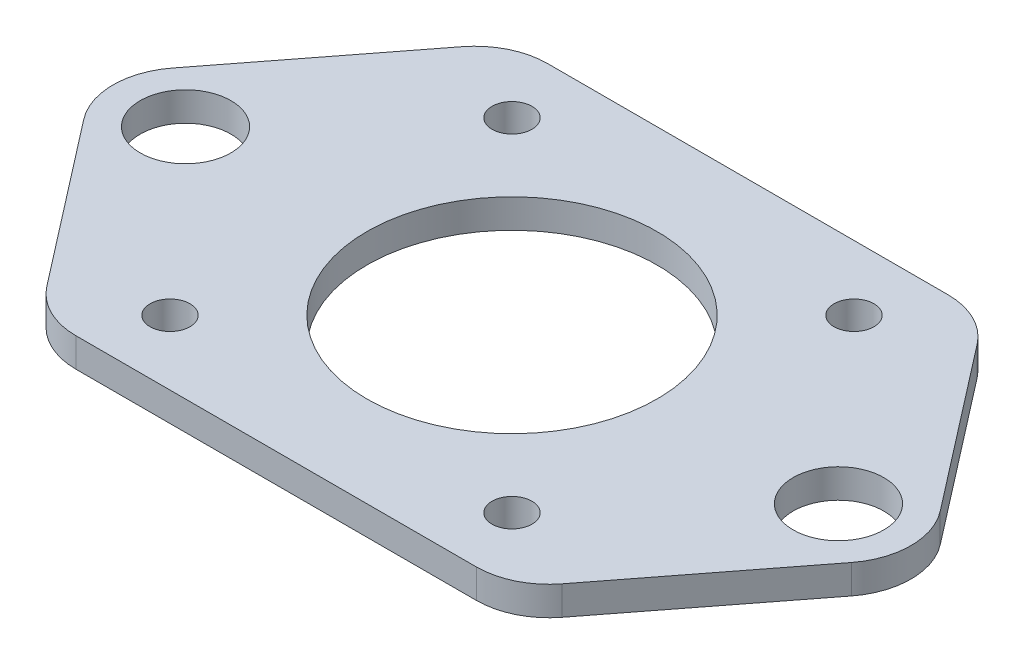
ISO-10303-21;
HEADER;
FILE_DESCRIPTION(('STEP AP214'),'2;1');
FILE_NAME('part.step','',(''),(''),'','','');
FILE_SCHEMA(('AUTOMOTIVE_DESIGN { 1 0 10303 214 1 1 1 1 }'));
ENDSEC;
DATA;
#1=APPLICATION_CONTEXT('core data for automotive mechanical design processes');
#2=APPLICATION_PROTOCOL_DEFINITION('international standard','automotive_design',2000,#1);
#3=PRODUCT_CONTEXT('',#1,'mechanical');
#4=PRODUCT('Part','Part','',(#3));
#5=PRODUCT_RELATED_PRODUCT_CATEGORY('part','',(#4));
#6=PRODUCT_DEFINITION_FORMATION('','',#4);
#7=PRODUCT_DEFINITION_CONTEXT('part definition',#1,'design');
#8=PRODUCT_DEFINITION('design','',#6,#7);
#9=PRODUCT_DEFINITION_SHAPE('','',#8);
#10=(LENGTH_UNIT() NAMED_UNIT(*) SI_UNIT(.MILLI.,.METRE.));
#11=(NAMED_UNIT(*) PLANE_ANGLE_UNIT() SI_UNIT($,.RADIAN.));
#12=(NAMED_UNIT(*) SI_UNIT($,.STERADIAN.) SOLID_ANGLE_UNIT());
#13=UNCERTAINTY_MEASURE_WITH_UNIT(LENGTH_MEASURE(1.E-05),#10,'distance_accuracy_value','');
#14=(GEOMETRIC_REPRESENTATION_CONTEXT(3) GLOBAL_UNCERTAINTY_ASSIGNED_CONTEXT((#13)) GLOBAL_UNIT_ASSIGNED_CONTEXT((#10,
#11,#12)) REPRESENTATION_CONTEXT('',''));
#15=CARTESIAN_POINT('',(0.,0.,0.));
#16=DIRECTION('',(0.,0.,1.));
#17=DIRECTION('',(1.,0.,0.));
#18=AXIS2_PLACEMENT_3D('',#15,#16,#17);
#19=CARTESIAN_POINT('',(-32.4999999999999,-4.,-32.5));
#20=DIRECTION('',(0.,0.,-1.));
#21=DIRECTION('',(-1.,0.,0.));
#22=AXIS2_PLACEMENT_3D('',#19,#20,#21);
#23=PLANE('',#22);
#24=DIRECTION('',(-1.,0.,0.));
#25=VECTOR('',#24,1.);
#26=CARTESIAN_POINT('',(-32.4999999999999,-4.,-32.5));
#27=LINE('',#26,#25);
#28=CARTESIAN_POINT('',(27.5931387858081,-4.,-32.5));
#29=VERTEX_POINT('',#28);
#30=CARTESIAN_POINT('',(-27.593138785808,-4.,-32.5));
#31=VERTEX_POINT('',#30);
#32=EDGE_CURVE('E142',#29,#31,#27,.T.);
#33=ORIENTED_EDGE('',*,*,#32,.T.);
#34=DIRECTION('',(0.,1.,0.));
#35=VECTOR('',#34,1.);
#36=CARTESIAN_POINT('',(-27.593138785808,-4.,-32.5));
#37=LINE('',#36,#35);
#38=CARTESIAN_POINT('',(-27.593138785808,0.,-32.5));
#39=VERTEX_POINT('',#38);
#40=EDGE_CURVE('E196',#31,#39,#37,.T.);
#41=ORIENTED_EDGE('',*,*,#40,.T.);
#42=DIRECTION('',(-1.,0.,0.));
#43=VECTOR('',#42,1.);
#44=CARTESIAN_POINT('',(-32.4999999999999,0.,-32.5));
#45=LINE('',#44,#43);
#46=CARTESIAN_POINT('',(27.5931387858081,0.,-32.5));
#47=VERTEX_POINT('',#46);
#48=EDGE_CURVE('E167',#47,#39,#45,.T.);
#49=ORIENTED_EDGE('',*,*,#48,.F.);
#50=DIRECTION('',(0.,1.,0.));
#51=VECTOR('',#50,1.);
#52=CARTESIAN_POINT('',(27.5931387858081,-4.,-32.5));
#53=LINE('',#52,#51);
#54=EDGE_CURVE('E190',#47,#29,#53,.F.);
#55=ORIENTED_EDGE('',*,*,#54,.T.);
#56=EDGE_LOOP('',(#33,#41,#49,#55));
#57=FACE_BOUND('',#56,.T.);
#58=ADVANCED_FACE('F40',(#57),#23,.T.);
#59=CARTESIAN_POINT('',(32.5000000000001,-4.,-32.5));
#60=DIRECTION('',(0.790936251719807,0.,-0.61189855835377));
#61=DIRECTION('',(-0.61189855835377,0.,-0.790936251719807));
#62=AXIS2_PLACEMENT_3D('',#59,#60,#61);
#63=PLANE('',#62);
#64=DIRECTION('',(-0.61189855835377,0.,-0.790936251719807));
#65=VECTOR('',#64,1.);
#66=CARTESIAN_POINT('',(32.5000000000001,-4.,-32.5));
#67=LINE('',#66,#65);
#68=CARTESIAN_POINT('',(52.9093625171981,-4.,-6.1189855835377));
#69=VERTEX_POINT('',#68);
#70=CARTESIAN_POINT('',(35.5025013030062,-4.,-28.6189855835377));
#71=VERTEX_POINT('',#70);
#72=EDGE_CURVE('E150',#69,#71,#67,.T.);
#73=ORIENTED_EDGE('',*,*,#72,.T.);
#74=DIRECTION('',(0.,1.,0.));
#75=VECTOR('',#74,1.);
#76=CARTESIAN_POINT('',(35.5025013030062,-4.,-28.6189855835377));
#77=LINE('',#76,#75);
#78=CARTESIAN_POINT('',(35.5025013030062,0.,-28.6189855835377));
#79=VERTEX_POINT('',#78);
#80=EDGE_CURVE('E214',#71,#79,#77,.T.);
#81=ORIENTED_EDGE('',*,*,#80,.T.);
#82=DIRECTION('',(-0.61189855835377,0.,-0.790936251719807));
#83=VECTOR('',#82,1.);
#84=CARTESIAN_POINT('',(32.5000000000001,0.,-32.5));
#85=LINE('',#84,#83);
#86=CARTESIAN_POINT('',(52.9093625171981,0.,-6.1189855835377));
#87=VERTEX_POINT('',#86);
#88=EDGE_CURVE('E185',#87,#79,#85,.T.);
#89=ORIENTED_EDGE('',*,*,#88,.F.);
#90=DIRECTION('',(0.,1.,0.));
#91=VECTOR('',#90,1.);
#92=CARTESIAN_POINT('',(52.9093625171981,-4.,-6.1189855835377));
#93=LINE('',#92,#91);
#94=EDGE_CURVE('E188',#69,#87,#93,.T.);
#95=ORIENTED_EDGE('',*,*,#94,.F.);
#96=EDGE_LOOP('',(#73,#81,#89,#95));
#97=FACE_BOUND('',#96,.T.);
#98=ADVANCED_FACE('F332',(#97),#63,.T.);
#99=CARTESIAN_POINT('',(45.,-4.,0.));
#100=DIRECTION('',(0.,1.,0.));
#101=DIRECTION('',(0.,0.,1.));
#102=AXIS2_PLACEMENT_3D('',#99,#100,#101);
#103=CYLINDRICAL_SURFACE('',#102,10.);
#104=CARTESIAN_POINT('',(45.,0.,0.));
#105=DIRECTION('',(0.,1.,0.));
#106=DIRECTION('',(0.,0.,1.));
#107=AXIS2_PLACEMENT_3D('',#104,#105,#106);
#108=CIRCLE('',#107,10.);
#109=CARTESIAN_POINT('',(52.9093625171981,0.,6.11898558353769));
#110=VERTEX_POINT('',#109);
#111=EDGE_CURVE('E182',#110,#87,#108,.T.);
#112=ORIENTED_EDGE('',*,*,#111,.F.);
#113=DIRECTION('',(0.,1.,0.));
#114=VECTOR('',#113,1.);
#115=CARTESIAN_POINT('',(52.9093625171981,-4.,6.11898558353769));
#116=LINE('',#115,#114);
#117=CARTESIAN_POINT('',(52.9093625171981,-4.,6.11898558353769));
#118=VERTEX_POINT('',#117);
#119=EDGE_CURVE('E191',#118,#110,#116,.T.);
#120=ORIENTED_EDGE('',*,*,#119,.F.);
#121=CARTESIAN_POINT('',(45.,-4.,0.));
#122=DIRECTION('',(0.,1.,0.));
#123=DIRECTION('',(0.,0.,1.));
#124=AXIS2_PLACEMENT_3D('',#121,#122,#123);
#125=CIRCLE('',#124,10.);
#126=EDGE_CURVE('E162',#118,#69,#125,.T.);
#127=ORIENTED_EDGE('',*,*,#126,.T.);
#128=ORIENTED_EDGE('',*,*,#94,.T.);
#129=EDGE_LOOP('',(#112,#120,#127,#128));
#130=FACE_BOUND('',#129,.T.);
#131=ADVANCED_FACE('F337',(#130),#103,.T.);
#132=CARTESIAN_POINT('',(32.5000000000001,-4.,32.5000000000001));
#133=DIRECTION('',(0.790936251719807,0.,0.611898558353769));
#134=DIRECTION('',(0.611898558353769,0.,-0.790936251719807));
#135=AXIS2_PLACEMENT_3D('',#132,#133,#134);
#136=PLANE('',#135);
#137=DIRECTION('',(0.611898558353769,0.,-0.790936251719807));
#138=VECTOR('',#137,1.);
#139=CARTESIAN_POINT('',(32.5000000000001,0.,32.5000000000001));
#140=LINE('',#139,#138);
#141=CARTESIAN_POINT('',(35.5025013030062,0.,28.6189855835378));
#142=VERTEX_POINT('',#141);
#143=EDGE_CURVE('E180',#142,#110,#140,.T.);
#144=ORIENTED_EDGE('',*,*,#143,.F.);
#145=DIRECTION('',(0.,1.,0.));
#146=VECTOR('',#145,1.);
#147=CARTESIAN_POINT('',(35.5025013030062,-4.,28.6189855835378));
#148=LINE('',#147,#146);
#149=CARTESIAN_POINT('',(35.5025013030062,-4.,28.6189855835378));
#150=VERTEX_POINT('',#149);
#151=EDGE_CURVE('E48',#142,#150,#148,.F.);
#152=ORIENTED_EDGE('',*,*,#151,.T.);
#153=DIRECTION('',(0.611898558353769,0.,-0.790936251719807));
#154=VECTOR('',#153,1.);
#155=CARTESIAN_POINT('',(32.5000000000001,-4.,32.5000000000001));
#156=LINE('',#155,#154);
#157=EDGE_CURVE('E160',#150,#118,#156,.T.);
#158=ORIENTED_EDGE('',*,*,#157,.T.);
#159=ORIENTED_EDGE('',*,*,#119,.T.);
#160=EDGE_LOOP('',(#144,#152,#158,#159));
#161=FACE_BOUND('',#160,.T.);
#162=ADVANCED_FACE('F224',(#161),#136,.T.);
#163=CARTESIAN_POINT('',(-32.5000000000001,-4.,32.5000000000001));
#164=DIRECTION('',(0.,0.,1.));
#165=DIRECTION('',(1.,0.,0.));
#166=AXIS2_PLACEMENT_3D('',#163,#164,#165);
#167=PLANE('',#166);
#168=DIRECTION('',(1.,0.,0.));
#169=VECTOR('',#168,1.);
#170=CARTESIAN_POINT('',(-32.5000000000001,-4.,32.5000000000001));
#171=LINE('',#170,#169);
#172=CARTESIAN_POINT('',(-27.5931387858081,-4.,32.5000000000001));
#173=VERTEX_POINT('',#172);
#174=CARTESIAN_POINT('',(27.5931387858081,-4.,32.5000000000001));
#175=VERTEX_POINT('',#174);
#176=EDGE_CURVE('E155',#173,#175,#171,.T.);
#177=ORIENTED_EDGE('',*,*,#176,.T.);
#178=DIRECTION('',(0.,1.,0.));
#179=VECTOR('',#178,1.);
#180=CARTESIAN_POINT('',(27.5931387858081,-4.,32.5000000000001));
#181=LINE('',#180,#179);
#182=CARTESIAN_POINT('',(27.5931387858081,0.,32.5000000000001));
#183=VERTEX_POINT('',#182);
#184=EDGE_CURVE('E219',#175,#183,#181,.T.);
#185=ORIENTED_EDGE('',*,*,#184,.T.);
#186=DIRECTION('',(1.,0.,0.));
#187=VECTOR('',#186,1.);
#188=CARTESIAN_POINT('',(-32.5000000000001,0.,32.5000000000001));
#189=LINE('',#188,#187);
#190=CARTESIAN_POINT('',(-27.5931387858081,0.,32.5000000000001));
#191=VERTEX_POINT('',#190);
#192=EDGE_CURVE('E177',#191,#183,#189,.T.);
#193=ORIENTED_EDGE('',*,*,#192,.F.);
#194=DIRECTION('',(0.,1.,0.));
#195=VECTOR('',#194,1.);
#196=CARTESIAN_POINT('',(-27.5931387858081,-4.,32.5000000000001));
#197=LINE('',#196,#195);
#198=EDGE_CURVE('E217',#191,#173,#197,.F.);
#199=ORIENTED_EDGE('',*,*,#198,.T.);
#200=EDGE_LOOP('',(#177,#185,#193,#199));
#201=FACE_BOUND('',#200,.T.);
#202=ADVANCED_FACE('F233',(#201),#167,.T.);
#203=CARTESIAN_POINT('',(-32.5000000000001,-4.,32.5000000000001));
#204=DIRECTION('',(-0.790936251719808,0.,0.611898558353769));
#205=DIRECTION('',(0.611898558353769,0.,0.790936251719808));
#206=AXIS2_PLACEMENT_3D('',#203,#204,#205);
#207=PLANE('',#206);
#208=DIRECTION('',(0.611898558353769,0.,0.790936251719808));
#209=VECTOR('',#208,1.);
#210=CARTESIAN_POINT('',(-32.5000000000001,-4.,32.5000000000001));
#211=LINE('',#210,#209);
#212=CARTESIAN_POINT('',(-52.9093625171981,-4.,6.11898558353768));
#213=VERTEX_POINT('',#212);
#214=CARTESIAN_POINT('',(-35.5025013030062,-4.,28.6189855835378));
#215=VERTEX_POINT('',#214);
#216=EDGE_CURVE('E153',#213,#215,#211,.T.);
#217=ORIENTED_EDGE('',*,*,#216,.T.);
#218=DIRECTION('',(0.,1.,0.));
#219=VECTOR('',#218,1.);
#220=CARTESIAN_POINT('',(-35.5025013030062,-4.,28.6189855835378));
#221=LINE('',#220,#219);
#222=CARTESIAN_POINT('',(-35.5025013030062,0.,28.6189855835378));
#223=VERTEX_POINT('',#222);
#224=EDGE_CURVE('E11',#215,#223,#221,.T.);
#225=ORIENTED_EDGE('',*,*,#224,.T.);
#226=DIRECTION('',(0.611898558353769,0.,0.790936251719808));
#227=VECTOR('',#226,1.);
#228=CARTESIAN_POINT('',(-32.5000000000001,0.,32.5000000000001));
#229=LINE('',#228,#227);
#230=CARTESIAN_POINT('',(-52.9093625171981,0.,6.11898558353768));
#231=VERTEX_POINT('',#230);
#232=EDGE_CURVE('E174',#231,#223,#229,.T.);
#233=ORIENTED_EDGE('',*,*,#232,.F.);
#234=DIRECTION('',(0.,1.,0.));
#235=VECTOR('',#234,1.);
#236=CARTESIAN_POINT('',(-52.9093625171981,-4.,6.11898558353768));
#237=LINE('',#236,#235);
#238=EDGE_CURVE('E149',#213,#231,#237,.T.);
#239=ORIENTED_EDGE('',*,*,#238,.F.);
#240=EDGE_LOOP('',(#217,#225,#233,#239));
#241=FACE_BOUND('',#240,.T.);
#242=ADVANCED_FACE('F241',(#241),#207,.T.);
#243=CARTESIAN_POINT('',(-45.,-4.,0.));
#244=DIRECTION('',(0.,1.,0.));
#245=DIRECTION('',(0.,0.,1.));
#246=AXIS2_PLACEMENT_3D('',#243,#244,#245);
#247=CYLINDRICAL_SURFACE('',#246,10.);
#248=CARTESIAN_POINT('',(-45.,0.,0.));
#249=DIRECTION('',(0.,1.,0.));
#250=DIRECTION('',(0.,0.,1.));
#251=AXIS2_PLACEMENT_3D('',#248,#249,#250);
#252=CIRCLE('',#251,10.);
#253=CARTESIAN_POINT('',(-52.909362517198,0.,-6.11898558353773));
#254=VERTEX_POINT('',#253);
#255=EDGE_CURVE('E148',#254,#231,#252,.T.);
#256=ORIENTED_EDGE('',*,*,#255,.F.);
#257=DIRECTION('',(0.,1.,0.));
#258=VECTOR('',#257,1.);
#259=CARTESIAN_POINT('',(-52.909362517198,-4.,-6.11898558353773));
#260=LINE('',#259,#258);
#261=CARTESIAN_POINT('',(-52.909362517198,-4.,-6.11898558353773));
#262=VERTEX_POINT('',#261);
#263=EDGE_CURVE('E135',#262,#254,#260,.T.);
#264=ORIENTED_EDGE('',*,*,#263,.F.);
#265=CARTESIAN_POINT('',(-45.,-4.,0.));
#266=DIRECTION('',(0.,1.,0.));
#267=DIRECTION('',(0.,0.,1.));
#268=AXIS2_PLACEMENT_3D('',#265,#266,#267);
#269=CIRCLE('',#268,10.);
#270=EDGE_CURVE('E141',#262,#213,#269,.T.);
#271=ORIENTED_EDGE('',*,*,#270,.T.);
#272=ORIENTED_EDGE('',*,*,#238,.T.);
#273=EDGE_LOOP('',(#256,#264,#271,#272));
#274=FACE_BOUND('',#273,.T.);
#275=ADVANCED_FACE('F146',(#274),#247,.T.);
#276=CARTESIAN_POINT('',(-32.4999999999999,-4.,-32.5));
#277=DIRECTION('',(-0.790936251719805,0.,-0.611898558353773));
#278=DIRECTION('',(-0.611898558353773,0.,0.790936251719805));
#279=AXIS2_PLACEMENT_3D('',#276,#277,#278);
#280=PLANE('',#279);
#281=DIRECTION('',(-0.611898558353773,0.,0.790936251719805));
#282=VECTOR('',#281,1.);
#283=CARTESIAN_POINT('',(-32.4999999999999,0.,-32.5));
#284=LINE('',#283,#282);
#285=CARTESIAN_POINT('',(-35.502501303006,0.,-28.6189855835377));
#286=VERTEX_POINT('',#285);
#287=EDGE_CURVE('E170',#286,#254,#284,.T.);
#288=ORIENTED_EDGE('',*,*,#287,.F.);
#289=DIRECTION('',(0.,1.,0.));
#290=VECTOR('',#289,1.);
#291=CARTESIAN_POINT('',(-35.502501303006,-4.,-28.6189855835377));
#292=LINE('',#291,#290);
#293=CARTESIAN_POINT('',(-35.502501303006,-4.,-28.6189855835377));
#294=VERTEX_POINT('',#293);
#295=EDGE_CURVE('E138',#286,#294,#292,.F.);
#296=ORIENTED_EDGE('',*,*,#295,.T.);
#297=DIRECTION('',(-0.611898558353773,0.,0.790936251719805));
#298=VECTOR('',#297,1.);
#299=CARTESIAN_POINT('',(-32.4999999999999,-4.,-32.5));
#300=LINE('',#299,#298);
#301=EDGE_CURVE('E131',#294,#262,#300,.T.);
#302=ORIENTED_EDGE('',*,*,#301,.T.);
#303=ORIENTED_EDGE('',*,*,#263,.T.);
#304=EDGE_LOOP('',(#288,#296,#302,#303));
#305=FACE_BOUND('',#304,.T.);
#306=ADVANCED_FACE('F134',(#305),#280,.T.);
#307=CARTESIAN_POINT('',(45.,-4.,0.));
#308=DIRECTION('',(0.,1.,0.));
#309=DIRECTION('',(0.,0.,1.));
#310=AXIS2_PLACEMENT_3D('',#307,#308,#309);
#311=PLANE('',#310);
#312=CARTESIAN_POINT('',(45.,-4.,0.));
#313=DIRECTION('',(0.,1.,0.));
#314=DIRECTION('',(0.,0.,1.));
#315=AXIS2_PLACEMENT_3D('',#312,#313,#314);
#316=CIRCLE('',#315,6.25);
#317=CARTESIAN_POINT('',(45.,-4.,6.25));
#318=VERTEX_POINT('',#317);
#319=EDGE_CURVE('E285',#318,#318,#316,.T.);
#320=ORIENTED_EDGE('',*,*,#319,.T.);
#321=EDGE_LOOP('',(#320));
#322=FACE_BOUND('',#321,.T.);
#323=CARTESIAN_POINT('',(-45.,-4.,0.));
#324=DIRECTION('',(0.,1.,0.));
#325=DIRECTION('',(0.,0.,1.));
#326=AXIS2_PLACEMENT_3D('',#323,#324,#325);
#327=CIRCLE('',#326,6.25000000000001);
#328=CARTESIAN_POINT('',(-45.,-4.,6.25000000000001));
#329=VERTEX_POINT('',#328);
#330=EDGE_CURVE('E279',#329,#329,#327,.T.);
#331=ORIENTED_EDGE('',*,*,#330,.T.);
#332=EDGE_LOOP('',(#331));
#333=FACE_BOUND('',#332,.T.);
#334=CARTESIAN_POINT('',(-23.57,-4.,23.57));
#335=DIRECTION('',(0.,1.,0.));
#336=DIRECTION('',(0.,0.,1.));
#337=AXIS2_PLACEMENT_3D('',#334,#335,#336);
#338=CIRCLE('',#337,2.74999999999999);
#339=CARTESIAN_POINT('',(-23.57,-4.,26.32));
#340=VERTEX_POINT('',#339);
#341=EDGE_CURVE('E273',#340,#340,#338,.T.);
#342=ORIENTED_EDGE('',*,*,#341,.T.);
#343=EDGE_LOOP('',(#342));
#344=FACE_BOUND('',#343,.T.);
#345=CARTESIAN_POINT('',(23.57,-4.,23.57));
#346=DIRECTION('',(0.,1.,0.));
#347=DIRECTION('',(0.,0.,1.));
#348=AXIS2_PLACEMENT_3D('',#345,#346,#347);
#349=CIRCLE('',#348,2.74999999999999);
#350=CARTESIAN_POINT('',(23.57,-4.,26.32));
#351=VERTEX_POINT('',#350);
#352=EDGE_CURVE('E267',#351,#351,#349,.T.);
#353=ORIENTED_EDGE('',*,*,#352,.T.);
#354=EDGE_LOOP('',(#353));
#355=FACE_BOUND('',#354,.T.);
#356=CARTESIAN_POINT('',(23.57,-4.,-23.57));
#357=DIRECTION('',(0.,1.,0.));
#358=DIRECTION('',(0.,0.,1.));
#359=AXIS2_PLACEMENT_3D('',#356,#357,#358);
#360=CIRCLE('',#359,2.74999999999999);
#361=CARTESIAN_POINT('',(23.57,-4.,-20.82));
#362=VERTEX_POINT('',#361);
#363=EDGE_CURVE('E261',#362,#362,#360,.T.);
#364=ORIENTED_EDGE('',*,*,#363,.T.);
#365=EDGE_LOOP('',(#364));
#366=FACE_BOUND('',#365,.T.);
#367=CARTESIAN_POINT('',(-23.57,-4.,-23.5699999999999));
#368=DIRECTION('',(0.,1.,0.));
#369=DIRECTION('',(0.,0.,1.));
#370=AXIS2_PLACEMENT_3D('',#367,#368,#369);
#371=CIRCLE('',#370,2.75000000000002);
#372=CARTESIAN_POINT('',(-23.57,-4.,-20.8199999999999));
#373=VERTEX_POINT('',#372);
#374=EDGE_CURVE('E255',#373,#373,#371,.T.);
#375=ORIENTED_EDGE('',*,*,#374,.T.);
#376=EDGE_LOOP('',(#375));
#377=FACE_BOUND('',#376,.T.);
#378=CARTESIAN_POINT('',(0.,-4.,0.));
#379=DIRECTION('',(0.,1.,0.));
#380=DIRECTION('',(0.,0.,1.));
#381=AXIS2_PLACEMENT_3D('',#378,#379,#380);
#382=CIRCLE('',#381,20.);
#383=CARTESIAN_POINT('',(0.,-4.,20.));
#384=VERTEX_POINT('',#383);
#385=EDGE_CURVE('E171',#384,#384,#382,.T.);
#386=ORIENTED_EDGE('',*,*,#385,.T.);
#387=EDGE_LOOP('',(#386));
#388=FACE_BOUND('',#387,.T.);
#389=ORIENTED_EDGE('',*,*,#301,.F.);
#390=CARTESIAN_POINT('',(-27.593138785808,-4.,-22.5));
#391=DIRECTION('',(0.,1.,0.));
#392=DIRECTION('',(0.,0.,1.));
#393=AXIS2_PLACEMENT_3D('',#390,#391,#392);
#394=CIRCLE('',#393,10.);
#395=EDGE_CURVE('E212',#294,#31,#394,.F.);
#396=ORIENTED_EDGE('',*,*,#395,.T.);
#397=ORIENTED_EDGE('',*,*,#32,.F.);
#398=CARTESIAN_POINT('',(27.5931387858081,-4.,-22.5));
#399=DIRECTION('',(0.,1.,0.));
#400=DIRECTION('',(0.,0.,1.));
#401=AXIS2_PLACEMENT_3D('',#398,#399,#400);
#402=CIRCLE('',#401,10.);
#403=EDGE_CURVE('E210',#29,#71,#402,.F.);
#404=ORIENTED_EDGE('',*,*,#403,.T.);
#405=ORIENTED_EDGE('',*,*,#72,.F.);
#406=ORIENTED_EDGE('',*,*,#126,.F.);
#407=ORIENTED_EDGE('',*,*,#157,.F.);
#408=CARTESIAN_POINT('',(27.5931387858081,-4.,22.5000000000001));
#409=DIRECTION('',(0.,1.,0.));
#410=DIRECTION('',(0.,0.,1.));
#411=AXIS2_PLACEMENT_3D('',#408,#409,#410);
#412=CIRCLE('',#411,10.);
#413=EDGE_CURVE('E61',#150,#175,#412,.F.);
#414=ORIENTED_EDGE('',*,*,#413,.T.);
#415=ORIENTED_EDGE('',*,*,#176,.F.);
#416=CARTESIAN_POINT('',(-27.5931387858081,-4.,22.5000000000001));
#417=DIRECTION('',(0.,1.,0.));
#418=DIRECTION('',(0.,0.,1.));
#419=AXIS2_PLACEMENT_3D('',#416,#417,#418);
#420=CIRCLE('',#419,10.);
#421=EDGE_CURVE('E55',#173,#215,#420,.F.);
#422=ORIENTED_EDGE('',*,*,#421,.T.);
#423=ORIENTED_EDGE('',*,*,#216,.F.);
#424=ORIENTED_EDGE('',*,*,#270,.F.);
#425=EDGE_LOOP('',(#389,#396,#397,#404,#405,#406,#407,#414,#415,#422,#423,#424));
#426=FACE_BOUND('',#425,.T.);
#427=ADVANCED_FACE('F152',(#322,#333,#344,#355,#366,#377,#388,#426),#311,.F.);
#428=CARTESIAN_POINT('',(45.,0.,0.));
#429=DIRECTION('',(0.,1.,0.));
#430=DIRECTION('',(0.,0.,1.));
#431=AXIS2_PLACEMENT_3D('',#428,#429,#430);
#432=PLANE('',#431);
#433=CARTESIAN_POINT('',(45.,0.,0.));
#434=DIRECTION('',(0.,1.,0.));
#435=DIRECTION('',(0.,0.,1.));
#436=AXIS2_PLACEMENT_3D('',#433,#434,#435);
#437=CIRCLE('',#436,6.25);
#438=CARTESIAN_POINT('',(45.,0.,6.25));
#439=VERTEX_POINT('',#438);
#440=EDGE_CURVE('E288',#439,#439,#437,.T.);
#441=ORIENTED_EDGE('',*,*,#440,.F.);
#442=EDGE_LOOP('',(#441));
#443=FACE_BOUND('',#442,.T.);
#444=CARTESIAN_POINT('',(-45.,0.,0.));
#445=DIRECTION('',(0.,1.,0.));
#446=DIRECTION('',(0.,0.,1.));
#447=AXIS2_PLACEMENT_3D('',#444,#445,#446);
#448=CIRCLE('',#447,6.25000000000001);
#449=CARTESIAN_POINT('',(-45.,0.,6.25000000000001));
#450=VERTEX_POINT('',#449);
#451=EDGE_CURVE('E282',#450,#450,#448,.T.);
#452=ORIENTED_EDGE('',*,*,#451,.F.);
#453=EDGE_LOOP('',(#452));
#454=FACE_BOUND('',#453,.T.);
#455=CARTESIAN_POINT('',(-23.57,0.,23.57));
#456=DIRECTION('',(0.,1.,0.));
#457=DIRECTION('',(0.,0.,1.));
#458=AXIS2_PLACEMENT_3D('',#455,#456,#457);
#459=CIRCLE('',#458,2.74999999999999);
#460=CARTESIAN_POINT('',(-23.57,0.,26.32));
#461=VERTEX_POINT('',#460);
#462=EDGE_CURVE('E276',#461,#461,#459,.T.);
#463=ORIENTED_EDGE('',*,*,#462,.F.);
#464=EDGE_LOOP('',(#463));
#465=FACE_BOUND('',#464,.T.);
#466=CARTESIAN_POINT('',(23.57,0.,23.57));
#467=DIRECTION('',(0.,1.,0.));
#468=DIRECTION('',(0.,0.,1.));
#469=AXIS2_PLACEMENT_3D('',#466,#467,#468);
#470=CIRCLE('',#469,2.74999999999999);
#471=CARTESIAN_POINT('',(23.57,0.,26.32));
#472=VERTEX_POINT('',#471);
#473=EDGE_CURVE('E270',#472,#472,#470,.T.);
#474=ORIENTED_EDGE('',*,*,#473,.F.);
#475=EDGE_LOOP('',(#474));
#476=FACE_BOUND('',#475,.T.);
#477=CARTESIAN_POINT('',(23.57,0.,-23.57));
#478=DIRECTION('',(0.,1.,0.));
#479=DIRECTION('',(0.,0.,1.));
#480=AXIS2_PLACEMENT_3D('',#477,#478,#479);
#481=CIRCLE('',#480,2.74999999999999);
#482=CARTESIAN_POINT('',(23.57,0.,-20.82));
#483=VERTEX_POINT('',#482);
#484=EDGE_CURVE('E264',#483,#483,#481,.T.);
#485=ORIENTED_EDGE('',*,*,#484,.F.);
#486=EDGE_LOOP('',(#485));
#487=FACE_BOUND('',#486,.T.);
#488=CARTESIAN_POINT('',(-23.57,0.,-23.5699999999999));
#489=DIRECTION('',(0.,1.,0.));
#490=DIRECTION('',(0.,0.,1.));
#491=AXIS2_PLACEMENT_3D('',#488,#489,#490);
#492=CIRCLE('',#491,2.75000000000002);
#493=CARTESIAN_POINT('',(-23.57,0.,-20.8199999999999));
#494=VERTEX_POINT('',#493);
#495=EDGE_CURVE('E258',#494,#494,#492,.T.);
#496=ORIENTED_EDGE('',*,*,#495,.F.);
#497=EDGE_LOOP('',(#496));
#498=FACE_BOUND('',#497,.T.);
#499=CARTESIAN_POINT('',(0.,0.,0.));
#500=DIRECTION('',(0.,1.,0.));
#501=DIRECTION('',(0.,0.,1.));
#502=AXIS2_PLACEMENT_3D('',#499,#500,#501);
#503=CIRCLE('',#502,20.);
#504=CARTESIAN_POINT('',(0.,0.,20.));
#505=VERTEX_POINT('',#504);
#506=EDGE_CURVE('E252',#505,#505,#503,.T.);
#507=ORIENTED_EDGE('',*,*,#506,.F.);
#508=EDGE_LOOP('',(#507));
#509=FACE_BOUND('',#508,.T.);
#510=ORIENTED_EDGE('',*,*,#48,.T.);
#511=CARTESIAN_POINT('',(-27.593138785808,0.,-22.5));
#512=DIRECTION('',(0.,1.,0.));
#513=DIRECTION('',(0.,0.,1.));
#514=AXIS2_PLACEMENT_3D('',#511,#512,#513);
#515=CIRCLE('',#514,10.);
#516=EDGE_CURVE('E205',#39,#286,#515,.T.);
#517=ORIENTED_EDGE('',*,*,#516,.T.);
#518=ORIENTED_EDGE('',*,*,#287,.T.);
#519=ORIENTED_EDGE('',*,*,#255,.T.);
#520=ORIENTED_EDGE('',*,*,#232,.T.);
#521=CARTESIAN_POINT('',(-27.5931387858081,0.,22.5000000000001));
#522=DIRECTION('',(0.,1.,0.));
#523=DIRECTION('',(0.,0.,1.));
#524=AXIS2_PLACEMENT_3D('',#521,#522,#523);
#525=CIRCLE('',#524,10.);
#526=EDGE_CURVE('E199',#223,#191,#525,.T.);
#527=ORIENTED_EDGE('',*,*,#526,.T.);
#528=ORIENTED_EDGE('',*,*,#192,.T.);
#529=CARTESIAN_POINT('',(27.5931387858081,0.,22.5000000000001));
#530=DIRECTION('',(0.,1.,0.));
#531=DIRECTION('',(0.,0.,1.));
#532=AXIS2_PLACEMENT_3D('',#529,#530,#531);
#533=CIRCLE('',#532,10.);
#534=EDGE_CURVE('E201',#183,#142,#533,.T.);
#535=ORIENTED_EDGE('',*,*,#534,.T.);
#536=ORIENTED_EDGE('',*,*,#143,.T.);
#537=ORIENTED_EDGE('',*,*,#111,.T.);
#538=ORIENTED_EDGE('',*,*,#88,.T.);
#539=CARTESIAN_POINT('',(27.5931387858081,0.,-22.5));
#540=DIRECTION('',(0.,1.,0.));
#541=DIRECTION('',(0.,0.,1.));
#542=AXIS2_PLACEMENT_3D('',#539,#540,#541);
#543=CIRCLE('',#542,10.);
#544=EDGE_CURVE('E203',#79,#47,#543,.T.);
#545=ORIENTED_EDGE('',*,*,#544,.T.);
#546=EDGE_LOOP('',(#510,#517,#518,#519,#520,#527,#528,#535,#536,#537,#538,#545));
#547=FACE_BOUND('',#546,.T.);
#548=ADVANCED_FACE('F236',(#443,#454,#465,#476,#487,#498,#509,#547),#432,.T.);
#549=CARTESIAN_POINT('',(0.,-4.,0.));
#550=DIRECTION('',(0.,1.,0.));
#551=DIRECTION('',(0.,0.,1.));
#552=AXIS2_PLACEMENT_3D('',#549,#550,#551);
#553=CYLINDRICAL_SURFACE('',#552,20.);
#554=ORIENTED_EDGE('',*,*,#385,.F.);
#555=EDGE_LOOP('',(#554));
#556=FACE_BOUND('',#555,.T.);
#557=ORIENTED_EDGE('',*,*,#506,.T.);
#558=EDGE_LOOP('',(#557));
#559=FACE_BOUND('',#558,.T.);
#560=ADVANCED_FACE('F305',(#556,#559),#553,.F.);
#561=CARTESIAN_POINT('',(-23.57,-4.,-23.5699999999999));
#562=DIRECTION('',(0.,1.,0.));
#563=DIRECTION('',(0.,0.,1.));
#564=AXIS2_PLACEMENT_3D('',#561,#562,#563);
#565=CYLINDRICAL_SURFACE('',#564,2.75000000000002);
#566=ORIENTED_EDGE('',*,*,#374,.F.);
#567=EDGE_LOOP('',(#566));
#568=FACE_BOUND('',#567,.T.);
#569=ORIENTED_EDGE('',*,*,#495,.T.);
#570=EDGE_LOOP('',(#569));
#571=FACE_BOUND('',#570,.T.);
#572=ADVANCED_FACE('F320',(#568,#571),#565,.F.);
#573=CARTESIAN_POINT('',(23.57,-4.,-23.57));
#574=DIRECTION('',(0.,1.,0.));
#575=DIRECTION('',(0.,0.,1.));
#576=AXIS2_PLACEMENT_3D('',#573,#574,#575);
#577=CYLINDRICAL_SURFACE('',#576,2.74999999999999);
#578=ORIENTED_EDGE('',*,*,#363,.F.);
#579=EDGE_LOOP('',(#578));
#580=FACE_BOUND('',#579,.T.);
#581=ORIENTED_EDGE('',*,*,#484,.T.);
#582=EDGE_LOOP('',(#581));
#583=FACE_BOUND('',#582,.T.);
#584=ADVANCED_FACE('F326',(#580,#583),#577,.F.);
#585=CARTESIAN_POINT('',(23.57,-4.,23.57));
#586=DIRECTION('',(0.,1.,0.));
#587=DIRECTION('',(0.,0.,1.));
#588=AXIS2_PLACEMENT_3D('',#585,#586,#587);
#589=CYLINDRICAL_SURFACE('',#588,2.74999999999999);
#590=ORIENTED_EDGE('',*,*,#352,.F.);
#591=EDGE_LOOP('',(#590));
#592=FACE_BOUND('',#591,.T.);
#593=ORIENTED_EDGE('',*,*,#473,.T.);
#594=EDGE_LOOP('',(#593));
#595=FACE_BOUND('',#594,.T.);
#596=ADVANCED_FACE('F464',(#592,#595),#589,.F.);
#597=CARTESIAN_POINT('',(-23.57,-4.,23.57));
#598=DIRECTION('',(0.,1.,0.));
#599=DIRECTION('',(0.,0.,1.));
#600=AXIS2_PLACEMENT_3D('',#597,#598,#599);
#601=CYLINDRICAL_SURFACE('',#600,2.74999999999999);
#602=ORIENTED_EDGE('',*,*,#341,.F.);
#603=EDGE_LOOP('',(#602));
#604=FACE_BOUND('',#603,.T.);
#605=ORIENTED_EDGE('',*,*,#462,.T.);
#606=EDGE_LOOP('',(#605));
#607=FACE_BOUND('',#606,.T.);
#608=ADVANCED_FACE('F453',(#604,#607),#601,.F.);
#609=CARTESIAN_POINT('',(-45.,-4.,0.));
#610=DIRECTION('',(0.,1.,0.));
#611=DIRECTION('',(0.,0.,1.));
#612=AXIS2_PLACEMENT_3D('',#609,#610,#611);
#613=CYLINDRICAL_SURFACE('',#612,6.25000000000001);
#614=ORIENTED_EDGE('',*,*,#330,.F.);
#615=EDGE_LOOP('',(#614));
#616=FACE_BOUND('',#615,.T.);
#617=ORIENTED_EDGE('',*,*,#451,.T.);
#618=EDGE_LOOP('',(#617));
#619=FACE_BOUND('',#618,.T.);
#620=ADVANCED_FACE('F299',(#616,#619),#613,.F.);
#621=CARTESIAN_POINT('',(45.,-4.,0.));
#622=DIRECTION('',(0.,1.,0.));
#623=DIRECTION('',(0.,0.,1.));
#624=AXIS2_PLACEMENT_3D('',#621,#622,#623);
#625=CYLINDRICAL_SURFACE('',#624,6.25);
#626=ORIENTED_EDGE('',*,*,#319,.F.);
#627=EDGE_LOOP('',(#626));
#628=FACE_BOUND('',#627,.T.);
#629=ORIENTED_EDGE('',*,*,#440,.T.);
#630=EDGE_LOOP('',(#629));
#631=FACE_BOUND('',#630,.T.);
#632=ADVANCED_FACE('F296',(#628,#631),#625,.F.);
#633=CARTESIAN_POINT('',(-27.593138785808,-4.,-22.5));
#634=DIRECTION('',(0.,1.,0.));
#635=DIRECTION('',(0.,0.,1.));
#636=AXIS2_PLACEMENT_3D('',#633,#634,#635);
#637=CYLINDRICAL_SURFACE('',#636,10.);
#638=ORIENTED_EDGE('',*,*,#395,.F.);
#639=ORIENTED_EDGE('',*,*,#295,.F.);
#640=ORIENTED_EDGE('',*,*,#516,.F.);
#641=ORIENTED_EDGE('',*,*,#40,.F.);
#642=EDGE_LOOP('',(#638,#639,#640,#641));
#643=FACE_BOUND('',#642,.T.);
#644=ADVANCED_FACE('F243',(#643),#637,.T.);
#645=CARTESIAN_POINT('',(27.5931387858081,-4.,-22.5));
#646=DIRECTION('',(0.,1.,0.));
#647=DIRECTION('',(0.,0.,1.));
#648=AXIS2_PLACEMENT_3D('',#645,#646,#647);
#649=CYLINDRICAL_SURFACE('',#648,10.);
#650=ORIENTED_EDGE('',*,*,#403,.F.);
#651=ORIENTED_EDGE('',*,*,#54,.F.);
#652=ORIENTED_EDGE('',*,*,#544,.F.);
#653=ORIENTED_EDGE('',*,*,#80,.F.);
#654=EDGE_LOOP('',(#650,#651,#652,#653));
#655=FACE_BOUND('',#654,.T.);
#656=ADVANCED_FACE('F345',(#655),#649,.T.);
#657=CARTESIAN_POINT('',(27.5931387858081,-4.,22.5000000000001));
#658=DIRECTION('',(0.,1.,0.));
#659=DIRECTION('',(0.,0.,1.));
#660=AXIS2_PLACEMENT_3D('',#657,#658,#659);
#661=CYLINDRICAL_SURFACE('',#660,10.);
#662=ORIENTED_EDGE('',*,*,#413,.F.);
#663=ORIENTED_EDGE('',*,*,#151,.F.);
#664=ORIENTED_EDGE('',*,*,#534,.F.);
#665=ORIENTED_EDGE('',*,*,#184,.F.);
#666=EDGE_LOOP('',(#662,#663,#664,#665));
#667=FACE_BOUND('',#666,.T.);
#668=ADVANCED_FACE('F230',(#667),#661,.T.);
#669=CARTESIAN_POINT('',(-27.5931387858081,-4.,22.5000000000001));
#670=DIRECTION('',(0.,1.,0.));
#671=DIRECTION('',(0.,0.,1.));
#672=AXIS2_PLACEMENT_3D('',#669,#670,#671);
#673=CYLINDRICAL_SURFACE('',#672,10.);
#674=ORIENTED_EDGE('',*,*,#421,.F.);
#675=ORIENTED_EDGE('',*,*,#198,.F.);
#676=ORIENTED_EDGE('',*,*,#526,.F.);
#677=ORIENTED_EDGE('',*,*,#224,.F.);
#678=EDGE_LOOP('',(#674,#675,#676,#677));
#679=FACE_BOUND('',#678,.T.);
#680=ADVANCED_FACE('F42',(#679),#673,.T.);
#681=CLOSED_SHELL('',(#58,#98,#131,#162,#202,#242,#275,#306,#427,#548,#560,#572,#584,#596,#608,
#620,#632,#644,#656,#668,#680));
#682=MANIFOLD_SOLID_BREP('B2',#681);
#683=ADVANCED_BREP_SHAPE_REPRESENTATION('',(#18,#682),#14);
#684=SHAPE_DEFINITION_REPRESENTATION(#9,#683);
ENDSEC;
END-ISO-10303-21;
